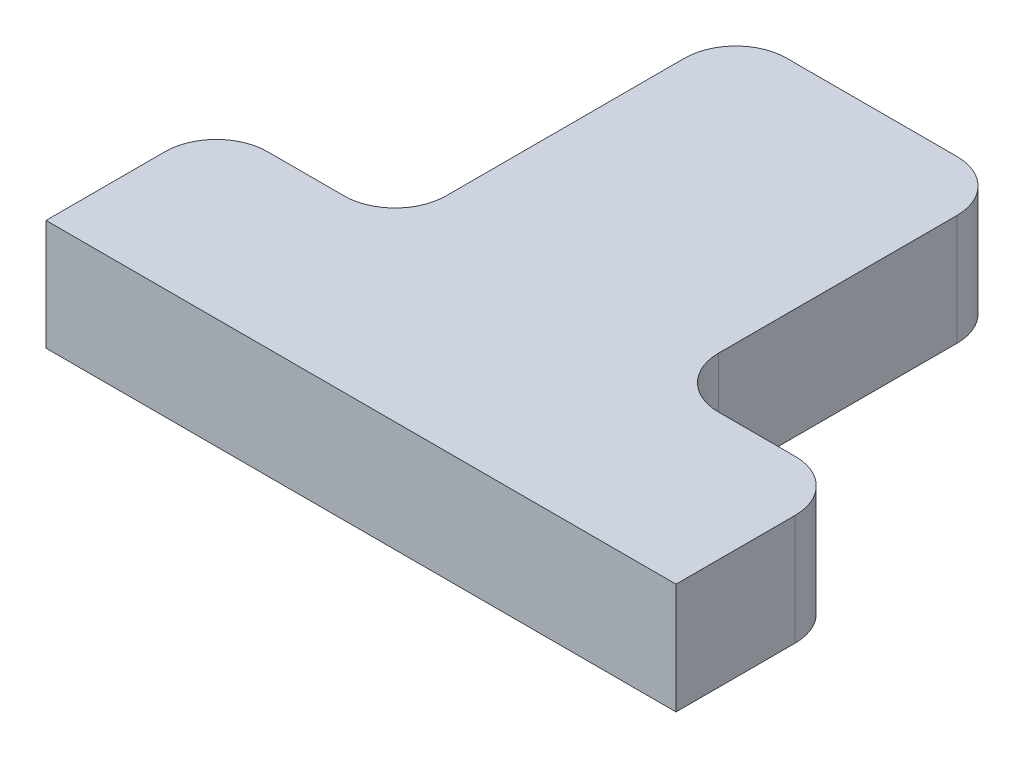
ISO-10303-21;
HEADER;
FILE_DESCRIPTION(('STEP AP214'),'2;1');
FILE_NAME('part.step','',(''),(''),'','','');
FILE_SCHEMA(('AUTOMOTIVE_DESIGN { 1 0 10303 214 1 1 1 1 }'));
ENDSEC;
DATA;
#1=APPLICATION_CONTEXT('core data for automotive mechanical design processes');
#2=APPLICATION_PROTOCOL_DEFINITION('international standard','automotive_design',2000,#1);
#3=PRODUCT_CONTEXT('',#1,'mechanical');
#4=PRODUCT('Part','Part','',(#3));
#5=PRODUCT_RELATED_PRODUCT_CATEGORY('part','',(#4));
#6=PRODUCT_DEFINITION_FORMATION('','',#4);
#7=PRODUCT_DEFINITION_CONTEXT('part definition',#1,'design');
#8=PRODUCT_DEFINITION('design','',#6,#7);
#9=PRODUCT_DEFINITION_SHAPE('','',#8);
#10=(LENGTH_UNIT() NAMED_UNIT(*) SI_UNIT(.MILLI.,.METRE.));
#11=(NAMED_UNIT(*) PLANE_ANGLE_UNIT() SI_UNIT($,.RADIAN.));
#12=(NAMED_UNIT(*) SI_UNIT($,.STERADIAN.) SOLID_ANGLE_UNIT());
#13=UNCERTAINTY_MEASURE_WITH_UNIT(LENGTH_MEASURE(1.E-05),#10,'distance_accuracy_value','');
#14=(GEOMETRIC_REPRESENTATION_CONTEXT(3) GLOBAL_UNCERTAINTY_ASSIGNED_CONTEXT((#13)) GLOBAL_UNIT_ASSIGNED_CONTEXT((#10,
#11,#12)) REPRESENTATION_CONTEXT('',''));
#15=CARTESIAN_POINT('',(0.,0.,0.));
#16=DIRECTION('',(0.,0.,1.));
#17=DIRECTION('',(1.,0.,0.));
#18=AXIS2_PLACEMENT_3D('',#15,#16,#17);
#19=CARTESIAN_POINT('',(0.,6.5,-10.));
#20=DIRECTION('',(0.,0.,1.));
#21=DIRECTION('',(1.,0.,0.));
#22=AXIS2_PLACEMENT_3D('',#19,#20,#21);
#23=PLANE('',#22);
#24=DIRECTION('',(-1.,0.,0.));
#25=VECTOR('',#24,1.);
#26=CARTESIAN_POINT('',(0.,0.,-10.));
#27=LINE('',#26,#25);
#28=CARTESIAN_POINT('',(-3.,0.,-10.));
#29=VERTEX_POINT('',#28);
#30=CARTESIAN_POINT('',(-7.5,0.,-10.));
#31=VERTEX_POINT('',#30);
#32=EDGE_CURVE('E177',#29,#31,#27,.T.);
#33=ORIENTED_EDGE('',*,*,#32,.T.);
#34=DIRECTION('',(0.,-1.,0.));
#35=VECTOR('',#34,1.);
#36=CARTESIAN_POINT('',(-7.5,6.5,-10.));
#37=LINE('',#36,#35);
#38=CARTESIAN_POINT('',(-7.5,6.5,-10.));
#39=VERTEX_POINT('',#38);
#40=EDGE_CURVE('E211',#31,#39,#37,.F.);
#41=ORIENTED_EDGE('',*,*,#40,.T.);
#42=DIRECTION('',(-1.,0.,0.));
#43=VECTOR('',#42,1.);
#44=CARTESIAN_POINT('',(0.,6.5,-10.));
#45=LINE('',#44,#43);
#46=CARTESIAN_POINT('',(-3.,6.5,-10.));
#47=VERTEX_POINT('',#46);
#48=EDGE_CURVE('E156',#47,#39,#45,.T.);
#49=ORIENTED_EDGE('',*,*,#48,.F.);
#50=DIRECTION('',(0.,-1.,0.));
#51=VECTOR('',#50,1.);
#52=CARTESIAN_POINT('',(-3.,6.5,-10.));
#53=LINE('',#52,#51);
#54=EDGE_CURVE('E208',#47,#29,#53,.T.);
#55=ORIENTED_EDGE('',*,*,#54,.T.);
#56=EDGE_LOOP('',(#33,#41,#49,#55));
#57=FACE_BOUND('',#56,.T.);
#58=ADVANCED_FACE('F33',(#57),#23,.F.);
#59=CARTESIAN_POINT('',(-10.5,6.5,0.));
#60=DIRECTION('',(-1.,0.,0.));
#61=DIRECTION('',(0.,0.,1.));
#62=AXIS2_PLACEMENT_3D('',#59,#60,#61);
#63=PLANE('',#62);
#64=DIRECTION('',(0.,0.,-1.));
#65=VECTOR('',#64,1.);
#66=CARTESIAN_POINT('',(-10.5,6.5,0.));
#67=LINE('',#66,#65);
#68=CARTESIAN_POINT('',(-10.5,6.5,0.));
#69=VERTEX_POINT('',#68);
#70=CARTESIAN_POINT('',(-10.5,6.5,-7.));
#71=VERTEX_POINT('',#70);
#72=EDGE_CURVE('E140',#69,#71,#67,.T.);
#73=ORIENTED_EDGE('',*,*,#72,.T.);
#74=DIRECTION('',(0.,-1.,0.));
#75=VECTOR('',#74,1.);
#76=CARTESIAN_POINT('',(-10.5,0.,-7.));
#77=LINE('',#76,#75);
#78=CARTESIAN_POINT('',(-10.5,0.,-7.));
#79=VERTEX_POINT('',#78);
#80=EDGE_CURVE('E146',#71,#79,#77,.T.);
#81=ORIENTED_EDGE('',*,*,#80,.T.);
#82=DIRECTION('',(0.,0.,-1.));
#83=VECTOR('',#82,1.);
#84=CARTESIAN_POINT('',(-10.5,0.,0.));
#85=LINE('',#84,#83);
#86=CARTESIAN_POINT('',(-10.5,0.,0.));
#87=VERTEX_POINT('',#86);
#88=EDGE_CURVE('E143',#87,#79,#85,.T.);
#89=ORIENTED_EDGE('',*,*,#88,.F.);
#90=DIRECTION('',(0.,-1.,0.));
#91=VECTOR('',#90,1.);
#92=CARTESIAN_POINT('',(-10.5,6.5,0.));
#93=LINE('',#92,#91);
#94=EDGE_CURVE('E136',#69,#87,#93,.T.);
#95=ORIENTED_EDGE('',*,*,#94,.F.);
#96=EDGE_LOOP('',(#73,#81,#89,#95));
#97=FACE_BOUND('',#96,.T.);
#98=ADVANCED_FACE('F138',(#97),#63,.T.);
#99=CARTESIAN_POINT('',(16.,6.5,0.));
#100=DIRECTION('',(0.,0.,-1.));
#101=DIRECTION('',(-1.,0.,0.));
#102=AXIS2_PLACEMENT_3D('',#99,#100,#101);
#103=PLANE('',#102);
#104=DIRECTION('',(1.,0.,0.));
#105=VECTOR('',#104,1.);
#106=CARTESIAN_POINT('',(16.,0.,0.));
#107=LINE('',#106,#105);
#108=CARTESIAN_POINT('',(26.5,0.,0.));
#109=VERTEX_POINT('',#108);
#110=EDGE_CURVE('E181',#87,#109,#107,.T.);
#111=ORIENTED_EDGE('',*,*,#110,.T.);
#112=DIRECTION('',(0.,-1.,0.));
#113=VECTOR('',#112,1.);
#114=CARTESIAN_POINT('',(26.5,6.5,0.));
#115=LINE('',#114,#113);
#116=CARTESIAN_POINT('',(26.5,6.5,0.));
#117=VERTEX_POINT('',#116);
#118=EDGE_CURVE('E147',#117,#109,#115,.T.);
#119=ORIENTED_EDGE('',*,*,#118,.F.);
#120=DIRECTION('',(-1.,0.,0.));
#121=VECTOR('',#120,1.);
#122=CARTESIAN_POINT('',(0.,6.5,0.));
#123=LINE('',#122,#121);
#124=EDGE_CURVE('E152',#117,#69,#123,.T.);
#125=ORIENTED_EDGE('',*,*,#124,.T.);
#126=ORIENTED_EDGE('',*,*,#94,.T.);
#127=EDGE_LOOP('',(#111,#119,#125,#126));
#128=FACE_BOUND('',#127,.T.);
#129=ADVANCED_FACE('F158',(#128),#103,.F.);
#130=CARTESIAN_POINT('',(26.5,6.5,0.));
#131=DIRECTION('',(-1.,0.,0.));
#132=DIRECTION('',(0.,0.,1.));
#133=AXIS2_PLACEMENT_3D('',#130,#131,#132);
#134=PLANE('',#133);
#135=DIRECTION('',(0.,0.,-1.));
#136=VECTOR('',#135,1.);
#137=CARTESIAN_POINT('',(26.5,0.,0.));
#138=LINE('',#137,#136);
#139=CARTESIAN_POINT('',(26.5,0.,-7.));
#140=VERTEX_POINT('',#139);
#141=EDGE_CURVE('E183',#109,#140,#138,.T.);
#142=ORIENTED_EDGE('',*,*,#141,.T.);
#143=DIRECTION('',(0.,-1.,0.));
#144=VECTOR('',#143,1.);
#145=CARTESIAN_POINT('',(26.5,6.5,-7.));
#146=LINE('',#145,#144);
#147=CARTESIAN_POINT('',(26.5,6.5,-7.));
#148=VERTEX_POINT('',#147);
#149=EDGE_CURVE('E224',#140,#148,#146,.F.);
#150=ORIENTED_EDGE('',*,*,#149,.T.);
#151=DIRECTION('',(0.,0.,-1.));
#152=VECTOR('',#151,1.);
#153=CARTESIAN_POINT('',(26.5,6.5,0.));
#154=LINE('',#153,#152);
#155=EDGE_CURVE('E161',#117,#148,#154,.T.);
#156=ORIENTED_EDGE('',*,*,#155,.F.);
#157=ORIENTED_EDGE('',*,*,#118,.T.);
#158=EDGE_LOOP('',(#142,#150,#156,#157));
#159=FACE_BOUND('',#158,.T.);
#160=ADVANCED_FACE('F283',(#159),#134,.F.);
#161=CARTESIAN_POINT('',(16.,6.5,-10.));
#162=DIRECTION('',(0.,0.,-1.));
#163=DIRECTION('',(-1.,0.,0.));
#164=AXIS2_PLACEMENT_3D('',#161,#162,#163);
#165=PLANE('',#164);
#166=DIRECTION('',(1.,0.,0.));
#167=VECTOR('',#166,1.);
#168=CARTESIAN_POINT('',(16.,6.5,-10.));
#169=LINE('',#168,#167);
#170=CARTESIAN_POINT('',(19.,6.5,-10.));
#171=VERTEX_POINT('',#170);
#172=CARTESIAN_POINT('',(23.5,6.5,-10.));
#173=VERTEX_POINT('',#172);
#174=EDGE_CURVE('E163',#171,#173,#169,.T.);
#175=ORIENTED_EDGE('',*,*,#174,.T.);
#176=DIRECTION('',(0.,-1.,0.));
#177=VECTOR('',#176,1.);
#178=CARTESIAN_POINT('',(23.5,0.,-10.));
#179=LINE('',#178,#177);
#180=CARTESIAN_POINT('',(23.5,0.,-10.));
#181=VERTEX_POINT('',#180);
#182=EDGE_CURVE('E221',#173,#181,#179,.T.);
#183=ORIENTED_EDGE('',*,*,#182,.T.);
#184=DIRECTION('',(1.,0.,0.));
#185=VECTOR('',#184,1.);
#186=CARTESIAN_POINT('',(16.,0.,-10.));
#187=LINE('',#186,#185);
#188=CARTESIAN_POINT('',(19.,0.,-10.));
#189=VERTEX_POINT('',#188);
#190=EDGE_CURVE('E186',#189,#181,#187,.T.);
#191=ORIENTED_EDGE('',*,*,#190,.F.);
#192=DIRECTION('',(0.,-1.,0.));
#193=VECTOR('',#192,1.);
#194=CARTESIAN_POINT('',(19.,6.5,-10.));
#195=LINE('',#194,#193);
#196=EDGE_CURVE('E219',#189,#171,#195,.F.);
#197=ORIENTED_EDGE('',*,*,#196,.T.);
#198=EDGE_LOOP('',(#175,#183,#191,#197));
#199=FACE_BOUND('',#198,.T.);
#200=ADVANCED_FACE('F251',(#199),#165,.T.);
#201=CARTESIAN_POINT('',(16.,6.5,-10.));
#202=DIRECTION('',(-1.,0.,0.));
#203=DIRECTION('',(0.,0.,1.));
#204=AXIS2_PLACEMENT_3D('',#201,#202,#203);
#205=PLANE('',#204);
#206=DIRECTION('',(0.,0.,-1.));
#207=VECTOR('',#206,1.);
#208=CARTESIAN_POINT('',(16.,6.5,-10.));
#209=LINE('',#208,#207);
#210=CARTESIAN_POINT('',(16.,6.5,-13.));
#211=VERTEX_POINT('',#210);
#212=CARTESIAN_POINT('',(16.,6.5,-27.));
#213=VERTEX_POINT('',#212);
#214=EDGE_CURVE('E169',#211,#213,#209,.T.);
#215=ORIENTED_EDGE('',*,*,#214,.F.);
#216=DIRECTION('',(0.,-1.,0.));
#217=VECTOR('',#216,1.);
#218=CARTESIAN_POINT('',(16.,6.5,-13.));
#219=LINE('',#218,#217);
#220=CARTESIAN_POINT('',(16.,0.,-13.));
#221=VERTEX_POINT('',#220);
#222=EDGE_CURVE('E232',#211,#221,#219,.T.);
#223=ORIENTED_EDGE('',*,*,#222,.T.);
#224=DIRECTION('',(0.,0.,-1.));
#225=VECTOR('',#224,1.);
#226=CARTESIAN_POINT('',(16.,0.,-10.));
#227=LINE('',#226,#225);
#228=CARTESIAN_POINT('',(16.,0.,-27.));
#229=VERTEX_POINT('',#228);
#230=EDGE_CURVE('E189',#221,#229,#227,.T.);
#231=ORIENTED_EDGE('',*,*,#230,.T.);
#232=DIRECTION('',(0.,-1.,0.));
#233=VECTOR('',#232,1.);
#234=CARTESIAN_POINT('',(16.,6.5,-27.));
#235=LINE('',#234,#233);
#236=EDGE_CURVE('E230',#229,#213,#235,.F.);
#237=ORIENTED_EDGE('',*,*,#236,.T.);
#238=EDGE_LOOP('',(#215,#223,#231,#237));
#239=FACE_BOUND('',#238,.T.);
#240=ADVANCED_FACE('F259',(#239),#205,.F.);
#241=CARTESIAN_POINT('',(0.,6.5,-30.));
#242=DIRECTION('',(0.,0.,-1.));
#243=DIRECTION('',(-1.,0.,0.));
#244=AXIS2_PLACEMENT_3D('',#241,#242,#243);
#245=PLANE('',#244);
#246=DIRECTION('',(1.,0.,0.));
#247=VECTOR('',#246,1.);
#248=CARTESIAN_POINT('',(0.,6.5,-30.));
#249=LINE('',#248,#247);
#250=CARTESIAN_POINT('',(3.,6.5,-30.));
#251=VERTEX_POINT('',#250);
#252=CARTESIAN_POINT('',(13.,6.5,-30.));
#253=VERTEX_POINT('',#252);
#254=EDGE_CURVE('E172',#251,#253,#249,.T.);
#255=ORIENTED_EDGE('',*,*,#254,.T.);
#256=DIRECTION('',(0.,-1.,0.));
#257=VECTOR('',#256,1.);
#258=CARTESIAN_POINT('',(13.,0.,-30.));
#259=LINE('',#258,#257);
#260=CARTESIAN_POINT('',(13.,0.,-30.));
#261=VERTEX_POINT('',#260);
#262=EDGE_CURVE('E237',#253,#261,#259,.T.);
#263=ORIENTED_EDGE('',*,*,#262,.T.);
#264=DIRECTION('',(1.,0.,0.));
#265=VECTOR('',#264,1.);
#266=CARTESIAN_POINT('',(0.,0.,-30.));
#267=LINE('',#266,#265);
#268=CARTESIAN_POINT('',(3.,0.,-30.));
#269=VERTEX_POINT('',#268);
#270=EDGE_CURVE('E192',#269,#261,#267,.T.);
#271=ORIENTED_EDGE('',*,*,#270,.F.);
#272=DIRECTION('',(0.,-1.,0.));
#273=VECTOR('',#272,1.);
#274=CARTESIAN_POINT('',(3.,6.5,-30.));
#275=LINE('',#274,#273);
#276=EDGE_CURVE('E235',#269,#251,#275,.F.);
#277=ORIENTED_EDGE('',*,*,#276,.T.);
#278=EDGE_LOOP('',(#255,#263,#271,#277));
#279=FACE_BOUND('',#278,.T.);
#280=ADVANCED_FACE('F265',(#279),#245,.T.);
#281=CARTESIAN_POINT('',(0.,6.5,-10.));
#282=DIRECTION('',(-1.,0.,0.));
#283=DIRECTION('',(0.,0.,1.));
#284=AXIS2_PLACEMENT_3D('',#281,#282,#283);
#285=PLANE('',#284);
#286=DIRECTION('',(0.,0.,-1.));
#287=VECTOR('',#286,1.);
#288=CARTESIAN_POINT('',(0.,0.,-10.));
#289=LINE('',#288,#287);
#290=CARTESIAN_POINT('',(0.,0.,-13.));
#291=VERTEX_POINT('',#290);
#292=CARTESIAN_POINT('',(0.,0.,-27.));
#293=VERTEX_POINT('',#292);
#294=EDGE_CURVE('E195',#291,#293,#289,.T.);
#295=ORIENTED_EDGE('',*,*,#294,.F.);
#296=DIRECTION('',(0.,-1.,0.));
#297=VECTOR('',#296,1.);
#298=CARTESIAN_POINT('',(0.,6.5,-13.));
#299=LINE('',#298,#297);
#300=CARTESIAN_POINT('',(0.,6.5,-13.));
#301=VERTEX_POINT('',#300);
#302=EDGE_CURVE('E55',#291,#301,#299,.F.);
#303=ORIENTED_EDGE('',*,*,#302,.T.);
#304=DIRECTION('',(0.,0.,-1.));
#305=VECTOR('',#304,1.);
#306=CARTESIAN_POINT('',(0.,6.5,-10.));
#307=LINE('',#306,#305);
#308=CARTESIAN_POINT('',(0.,6.5,-27.));
#309=VERTEX_POINT('',#308);
#310=EDGE_CURVE('E175',#301,#309,#307,.T.);
#311=ORIENTED_EDGE('',*,*,#310,.T.);
#312=DIRECTION('',(0.,-1.,0.));
#313=VECTOR('',#312,1.);
#314=CARTESIAN_POINT('',(0.,6.5,-27.));
#315=LINE('',#314,#313);
#316=EDGE_CURVE('E226',#309,#293,#315,.T.);
#317=ORIENTED_EDGE('',*,*,#316,.T.);
#318=EDGE_LOOP('',(#295,#303,#311,#317));
#319=FACE_BOUND('',#318,.T.);
#320=ADVANCED_FACE('F270',(#319),#285,.T.);
#321=CARTESIAN_POINT('',(0.,6.5,0.));
#322=DIRECTION('',(0.,-1.,0.));
#323=DIRECTION('',(0.,0.,-1.));
#324=AXIS2_PLACEMENT_3D('',#321,#322,#323);
#325=PLANE('',#324);
#326=ORIENTED_EDGE('',*,*,#48,.T.);
#327=CARTESIAN_POINT('',(-7.5,6.5,-7.));
#328=DIRECTION('',(0.,-1.,0.));
#329=DIRECTION('',(0.,0.,-1.));
#330=AXIS2_PLACEMENT_3D('',#327,#328,#329);
#331=CIRCLE('',#330,3.);
#332=EDGE_CURVE('E155',#39,#71,#331,.F.);
#333=ORIENTED_EDGE('',*,*,#332,.T.);
#334=ORIENTED_EDGE('',*,*,#72,.F.);
#335=ORIENTED_EDGE('',*,*,#124,.F.);
#336=ORIENTED_EDGE('',*,*,#155,.T.);
#337=CARTESIAN_POINT('',(23.5,6.5,-7.));
#338=DIRECTION('',(0.,-1.,0.));
#339=DIRECTION('',(0.,0.,-1.));
#340=AXIS2_PLACEMENT_3D('',#337,#338,#339);
#341=CIRCLE('',#340,3.);
#342=EDGE_CURVE('E216',#148,#173,#341,.F.);
#343=ORIENTED_EDGE('',*,*,#342,.T.);
#344=ORIENTED_EDGE('',*,*,#174,.F.);
#345=CARTESIAN_POINT('',(19.,6.5,-13.));
#346=DIRECTION('',(0.,-1.,0.));
#347=DIRECTION('',(0.,0.,-1.));
#348=AXIS2_PLACEMENT_3D('',#345,#346,#347);
#349=CIRCLE('',#348,3.);
#350=EDGE_CURVE('E11',#171,#211,#349,.T.);
#351=ORIENTED_EDGE('',*,*,#350,.T.);
#352=ORIENTED_EDGE('',*,*,#214,.T.);
#353=CARTESIAN_POINT('',(13.,6.5,-27.));
#354=DIRECTION('',(0.,-1.,0.));
#355=DIRECTION('',(0.,0.,-1.));
#356=AXIS2_PLACEMENT_3D('',#353,#354,#355);
#357=CIRCLE('',#356,3.);
#358=EDGE_CURVE('E214',#213,#253,#357,.F.);
#359=ORIENTED_EDGE('',*,*,#358,.T.);
#360=ORIENTED_EDGE('',*,*,#254,.F.);
#361=CARTESIAN_POINT('',(3.,6.5,-27.));
#362=DIRECTION('',(0.,-1.,0.));
#363=DIRECTION('',(0.,0.,-1.));
#364=AXIS2_PLACEMENT_3D('',#361,#362,#363);
#365=CIRCLE('',#364,3.);
#366=EDGE_CURVE('E48',#251,#309,#365,.F.);
#367=ORIENTED_EDGE('',*,*,#366,.T.);
#368=ORIENTED_EDGE('',*,*,#310,.F.);
#369=CARTESIAN_POINT('',(-3.,6.5,-13.));
#370=DIRECTION('',(0.,-1.,0.));
#371=DIRECTION('',(0.,0.,-1.));
#372=AXIS2_PLACEMENT_3D('',#369,#370,#371);
#373=CIRCLE('',#372,3.);
#374=EDGE_CURVE('E242',#301,#47,#373,.T.);
#375=ORIENTED_EDGE('',*,*,#374,.T.);
#376=EDGE_LOOP('',(#326,#333,#334,#335,#336,#343,#344,#351,#352,#359,#360,#367,#368,#375));
#377=FACE_BOUND('',#376,.T.);
#378=ADVANCED_FACE('F150',(#377),#325,.F.);
#379=CARTESIAN_POINT('',(0.,0.,0.));
#380=DIRECTION('',(0.,-1.,0.));
#381=DIRECTION('',(0.,0.,-1.));
#382=AXIS2_PLACEMENT_3D('',#379,#380,#381);
#383=PLANE('',#382);
#384=ORIENTED_EDGE('',*,*,#88,.T.);
#385=CARTESIAN_POINT('',(-7.5,0.,-7.));
#386=DIRECTION('',(0.,-1.,0.));
#387=DIRECTION('',(0.,0.,-1.));
#388=AXIS2_PLACEMENT_3D('',#385,#386,#387);
#389=CIRCLE('',#388,3.);
#390=EDGE_CURVE('E206',#79,#31,#389,.T.);
#391=ORIENTED_EDGE('',*,*,#390,.T.);
#392=ORIENTED_EDGE('',*,*,#32,.F.);
#393=CARTESIAN_POINT('',(-3.,0.,-13.));
#394=DIRECTION('',(0.,-1.,0.));
#395=DIRECTION('',(0.,0.,-1.));
#396=AXIS2_PLACEMENT_3D('',#393,#394,#395);
#397=CIRCLE('',#396,3.);
#398=EDGE_CURVE('E240',#29,#291,#397,.F.);
#399=ORIENTED_EDGE('',*,*,#398,.T.);
#400=ORIENTED_EDGE('',*,*,#294,.T.);
#401=CARTESIAN_POINT('',(3.,0.,-27.));
#402=DIRECTION('',(0.,-1.,0.));
#403=DIRECTION('',(0.,0.,-1.));
#404=AXIS2_PLACEMENT_3D('',#401,#402,#403);
#405=CIRCLE('',#404,3.);
#406=EDGE_CURVE('E200',#293,#269,#405,.T.);
#407=ORIENTED_EDGE('',*,*,#406,.T.);
#408=ORIENTED_EDGE('',*,*,#270,.T.);
#409=CARTESIAN_POINT('',(13.,0.,-27.));
#410=DIRECTION('',(0.,-1.,0.));
#411=DIRECTION('',(0.,0.,-1.));
#412=AXIS2_PLACEMENT_3D('',#409,#410,#411);
#413=CIRCLE('',#412,3.);
#414=EDGE_CURVE('E202',#261,#229,#413,.T.);
#415=ORIENTED_EDGE('',*,*,#414,.T.);
#416=ORIENTED_EDGE('',*,*,#230,.F.);
#417=CARTESIAN_POINT('',(19.,0.,-13.));
#418=DIRECTION('',(0.,-1.,0.));
#419=DIRECTION('',(0.,0.,-1.));
#420=AXIS2_PLACEMENT_3D('',#417,#418,#419);
#421=CIRCLE('',#420,3.);
#422=EDGE_CURVE('E41',#221,#189,#421,.F.);
#423=ORIENTED_EDGE('',*,*,#422,.T.);
#424=ORIENTED_EDGE('',*,*,#190,.T.);
#425=CARTESIAN_POINT('',(23.5,0.,-7.));
#426=DIRECTION('',(0.,-1.,0.));
#427=DIRECTION('',(0.,0.,-1.));
#428=AXIS2_PLACEMENT_3D('',#425,#426,#427);
#429=CIRCLE('',#428,3.);
#430=EDGE_CURVE('E204',#181,#140,#429,.T.);
#431=ORIENTED_EDGE('',*,*,#430,.T.);
#432=ORIENTED_EDGE('',*,*,#141,.F.);
#433=ORIENTED_EDGE('',*,*,#110,.F.);
#434=EDGE_LOOP('',(#384,#391,#392,#399,#400,#407,#408,#415,#416,#423,#424,#431,#432,#433));
#435=FACE_BOUND('',#434,.T.);
#436=ADVANCED_FACE('F246',(#435),#383,.T.);
#437=CARTESIAN_POINT('',(-7.5,6.5,-7.));
#438=DIRECTION('',(0.,1.,0.));
#439=DIRECTION('',(0.,0.,1.));
#440=AXIS2_PLACEMENT_3D('',#437,#438,#439);
#441=CYLINDRICAL_SURFACE('',#440,3.);
#442=ORIENTED_EDGE('',*,*,#332,.F.);
#443=ORIENTED_EDGE('',*,*,#40,.F.);
#444=ORIENTED_EDGE('',*,*,#390,.F.);
#445=ORIENTED_EDGE('',*,*,#80,.F.);
#446=EDGE_LOOP('',(#442,#443,#444,#445));
#447=FACE_BOUND('',#446,.T.);
#448=ADVANCED_FACE('F280',(#447),#441,.T.);
#449=CARTESIAN_POINT('',(23.5,6.5,-7.));
#450=DIRECTION('',(0.,1.,0.));
#451=DIRECTION('',(0.,0.,1.));
#452=AXIS2_PLACEMENT_3D('',#449,#450,#451);
#453=CYLINDRICAL_SURFACE('',#452,3.);
#454=ORIENTED_EDGE('',*,*,#342,.F.);
#455=ORIENTED_EDGE('',*,*,#149,.F.);
#456=ORIENTED_EDGE('',*,*,#430,.F.);
#457=ORIENTED_EDGE('',*,*,#182,.F.);
#458=EDGE_LOOP('',(#454,#455,#456,#457));
#459=FACE_BOUND('',#458,.T.);
#460=ADVANCED_FACE('F287',(#459),#453,.T.);
#461=CARTESIAN_POINT('',(-3.,6.5,-13.));
#462=DIRECTION('',(0.,-1.,0.));
#463=DIRECTION('',(0.,0.,-1.));
#464=AXIS2_PLACEMENT_3D('',#461,#462,#463);
#465=CYLINDRICAL_SURFACE('',#464,3.);
#466=ORIENTED_EDGE('',*,*,#374,.F.);
#467=ORIENTED_EDGE('',*,*,#302,.F.);
#468=ORIENTED_EDGE('',*,*,#398,.F.);
#469=ORIENTED_EDGE('',*,*,#54,.F.);
#470=EDGE_LOOP('',(#466,#467,#468,#469));
#471=FACE_BOUND('',#470,.T.);
#472=ADVANCED_FACE('F275',(#471),#465,.F.);
#473=CARTESIAN_POINT('',(19.,6.5,-13.));
#474=DIRECTION('',(0.,-1.,0.));
#475=DIRECTION('',(0.,0.,-1.));
#476=AXIS2_PLACEMENT_3D('',#473,#474,#475);
#477=CYLINDRICAL_SURFACE('',#476,3.);
#478=ORIENTED_EDGE('',*,*,#350,.F.);
#479=ORIENTED_EDGE('',*,*,#196,.F.);
#480=ORIENTED_EDGE('',*,*,#422,.F.);
#481=ORIENTED_EDGE('',*,*,#222,.F.);
#482=EDGE_LOOP('',(#478,#479,#480,#481));
#483=FACE_BOUND('',#482,.T.);
#484=ADVANCED_FACE('F255',(#483),#477,.F.);
#485=CARTESIAN_POINT('',(13.,6.5,-27.));
#486=DIRECTION('',(0.,1.,0.));
#487=DIRECTION('',(0.,0.,1.));
#488=AXIS2_PLACEMENT_3D('',#485,#486,#487);
#489=CYLINDRICAL_SURFACE('',#488,3.);
#490=ORIENTED_EDGE('',*,*,#358,.F.);
#491=ORIENTED_EDGE('',*,*,#236,.F.);
#492=ORIENTED_EDGE('',*,*,#414,.F.);
#493=ORIENTED_EDGE('',*,*,#262,.F.);
#494=EDGE_LOOP('',(#490,#491,#492,#493));
#495=FACE_BOUND('',#494,.T.);
#496=ADVANCED_FACE('F262',(#495),#489,.T.);
#497=CARTESIAN_POINT('',(3.,6.5,-27.));
#498=DIRECTION('',(0.,-1.,0.));
#499=DIRECTION('',(0.,0.,-1.));
#500=AXIS2_PLACEMENT_3D('',#497,#498,#499);
#501=CYLINDRICAL_SURFACE('',#500,3.);
#502=ORIENTED_EDGE('',*,*,#366,.F.);
#503=ORIENTED_EDGE('',*,*,#276,.F.);
#504=ORIENTED_EDGE('',*,*,#406,.F.);
#505=ORIENTED_EDGE('',*,*,#316,.F.);
#506=EDGE_LOOP('',(#502,#503,#504,#505));
#507=FACE_BOUND('',#506,.T.);
#508=ADVANCED_FACE('F35',(#507),#501,.T.);
#509=CLOSED_SHELL('',(#58,#98,#129,#160,#200,#240,#280,#320,#378,#436,#448,#460,#472,#484,#496,#508));
#510=MANIFOLD_SOLID_BREP('B2',#509);
#511=ADVANCED_BREP_SHAPE_REPRESENTATION('',(#18,#510),#14);
#512=SHAPE_DEFINITION_REPRESENTATION(#9,#511);
ENDSEC;
END-ISO-10303-21;
